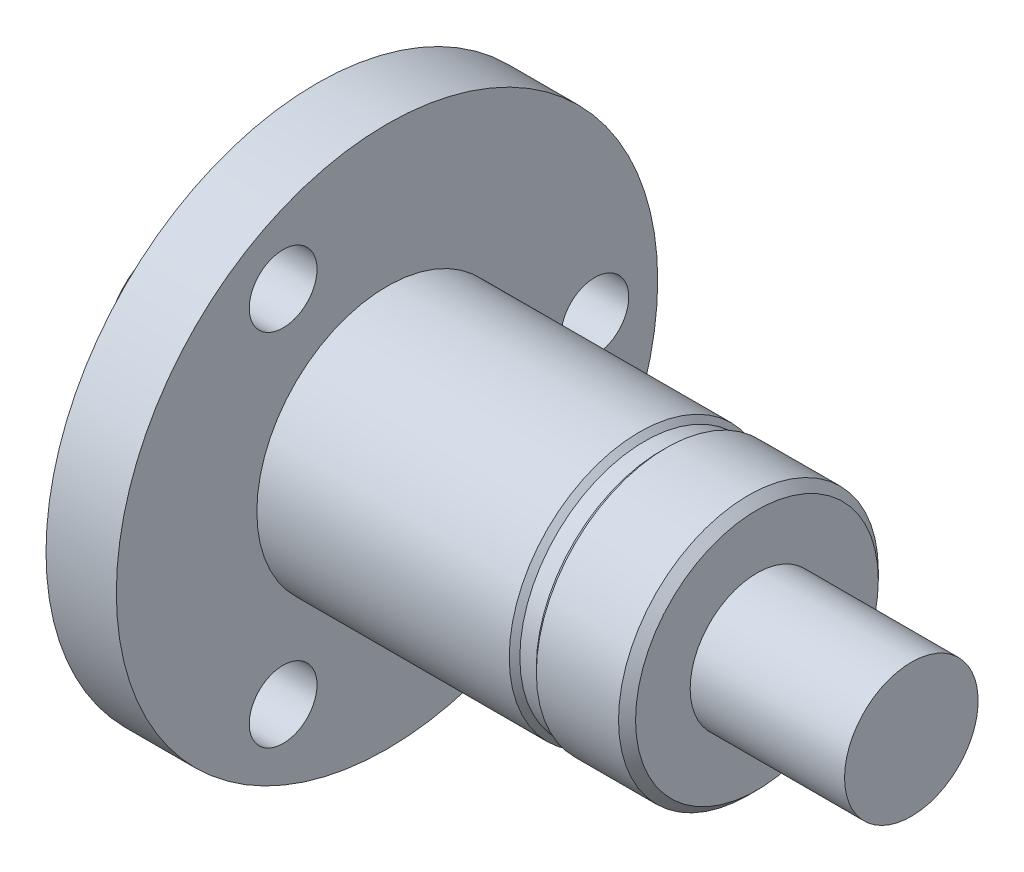
ISO-10303-21;
HEADER;
FILE_DESCRIPTION(('STEP AP214'),'2;1');
FILE_NAME('part.step','',(''),(''),'','','');
FILE_SCHEMA(('AUTOMOTIVE_DESIGN { 1 0 10303 214 1 1 1 1 }'));
ENDSEC;
DATA;
#1=APPLICATION_CONTEXT('core data for automotive mechanical design processes');
#2=APPLICATION_PROTOCOL_DEFINITION('international standard','automotive_design',2000,#1);
#3=PRODUCT_CONTEXT('',#1,'mechanical');
#4=PRODUCT('Part','Part','',(#3));
#5=PRODUCT_RELATED_PRODUCT_CATEGORY('part','',(#4));
#6=PRODUCT_DEFINITION_FORMATION('','',#4);
#7=PRODUCT_DEFINITION_CONTEXT('part definition',#1,'design');
#8=PRODUCT_DEFINITION('design','',#6,#7);
#9=PRODUCT_DEFINITION_SHAPE('','',#8);
#10=(LENGTH_UNIT() NAMED_UNIT(*) SI_UNIT(.MILLI.,.METRE.));
#11=(NAMED_UNIT(*) PLANE_ANGLE_UNIT() SI_UNIT($,.RADIAN.));
#12=(NAMED_UNIT(*) SI_UNIT($,.STERADIAN.) SOLID_ANGLE_UNIT());
#13=UNCERTAINTY_MEASURE_WITH_UNIT(LENGTH_MEASURE(1.E-05),#10,'distance_accuracy_value','');
#14=(GEOMETRIC_REPRESENTATION_CONTEXT(3) GLOBAL_UNCERTAINTY_ASSIGNED_CONTEXT((#13)) GLOBAL_UNIT_ASSIGNED_CONTEXT((#10,
#11,#12)) REPRESENTATION_CONTEXT('',''));
#15=CARTESIAN_POINT('',(0.,0.,0.));
#16=DIRECTION('',(0.,0.,1.));
#17=DIRECTION('',(1.,0.,0.));
#18=AXIS2_PLACEMENT_3D('',#15,#16,#17);
#19=CARTESIAN_POINT('',(-10.1,0.,0.));
#20=DIRECTION('',(1.,0.,0.));
#21=DIRECTION('',(0.,0.,-1.));
#22=AXIS2_PLACEMENT_3D('',#19,#20,#21);
#23=PLANE('',#22);
#24=CARTESIAN_POINT('',(-10.1,0.,0.));
#25=DIRECTION('',(-1.,0.,0.));
#26=DIRECTION('',(0.,0.,1.));
#27=AXIS2_PLACEMENT_3D('',#24,#25,#26);
#28=CIRCLE('',#27,3.13359790887331);
#29=CARTESIAN_POINT('',(-10.1,0.,3.13359790887331));
#30=VERTEX_POINT('',#29);
#31=EDGE_CURVE('E72',#30,#30,#28,.T.);
#32=ORIENTED_EDGE('',*,*,#31,.T.);
#33=EDGE_LOOP('',(#32));
#34=FACE_BOUND('',#33,.T.);
#35=ADVANCED_FACE('F34',(#34),#23,.F.);
#36=CARTESIAN_POINT('',(24.6,0.,0.));
#37=DIRECTION('',(-1.,0.,0.));
#38=DIRECTION('',(0.,0.,1.));
#39=AXIS2_PLACEMENT_3D('',#36,#37,#38);
#40=PLANE('',#39);
#41=CARTESIAN_POINT('',(24.6,0.,0.));
#42=DIRECTION('',(-1.,0.,0.));
#43=DIRECTION('',(0.,0.,1.));
#44=AXIS2_PLACEMENT_3D('',#41,#42,#43);
#45=CIRCLE('',#44,3.13359790887331);
#46=CARTESIAN_POINT('',(24.6,0.,3.13359790887331));
#47=VERTEX_POINT('',#46);
#48=EDGE_CURVE('E60',#47,#47,#45,.T.);
#49=ORIENTED_EDGE('',*,*,#48,.F.);
#50=EDGE_LOOP('',(#49));
#51=FACE_BOUND('',#50,.T.);
#52=ADVANCED_FACE('F127',(#51),#40,.F.);
#53=CARTESIAN_POINT('',(-3.3,0.,0.));
#54=DIRECTION('',(-1.,0.,0.));
#55=DIRECTION('',(0.,0.,1.));
#56=AXIS2_PLACEMENT_3D('',#53,#54,#55);
#57=CYLINDRICAL_SURFACE('',#56,3.13359790887331);
#58=ORIENTED_EDGE('',*,*,#48,.T.);
#59=EDGE_LOOP('',(#58));
#60=FACE_BOUND('',#59,.T.);
#61=CARTESIAN_POINT('',(17.3559058632868,0.,0.));
#62=DIRECTION('',(-1.,0.,0.));
#63=DIRECTION('',(0.,0.,1.));
#64=AXIS2_PLACEMENT_3D('',#61,#62,#63);
#65=CIRCLE('',#64,3.13359790887331);
#66=CARTESIAN_POINT('',(17.3559058632868,0.,3.13359790887331));
#67=VERTEX_POINT('',#66);
#68=EDGE_CURVE('E75',#67,#67,#65,.T.);
#69=ORIENTED_EDGE('',*,*,#68,.F.);
#70=EDGE_LOOP('',(#69));
#71=FACE_BOUND('',#70,.T.);
#72=ADVANCED_FACE('F133',(#60,#71),#57,.T.);
#73=CARTESIAN_POINT('',(17.3559058632868,0.,0.));
#74=DIRECTION('',(1.,0.,0.));
#75=DIRECTION('',(0.,0.,-1.));
#76=AXIS2_PLACEMENT_3D('',#73,#74,#75);
#77=PLANE('',#76);
#78=CARTESIAN_POINT('',(17.3559058632868,0.,0.));
#79=DIRECTION('',(1.,0.,0.));
#80=DIRECTION('',(0.,0.,-1.));
#81=AXIS2_PLACEMENT_3D('',#78,#79,#80);
#82=CIRCLE('',#81,5.69499999999999);
#83=CARTESIAN_POINT('',(17.3559058632868,0.,-5.69499999999999));
#84=VERTEX_POINT('',#83);
#85=EDGE_CURVE('E49',#84,#84,#82,.T.);
#86=ORIENTED_EDGE('',*,*,#85,.T.);
#87=EDGE_LOOP('',(#86));
#88=FACE_BOUND('',#87,.T.);
#89=ORIENTED_EDGE('',*,*,#68,.T.);
#90=EDGE_LOOP('',(#89));
#91=FACE_BOUND('',#90,.T.);
#92=ADVANCED_FACE('F152',(#88,#91),#77,.T.);
#93=CARTESIAN_POINT('',(-3.3,0.,0.));
#94=DIRECTION('',(-1.,0.,0.));
#95=DIRECTION('',(0.,0.,1.));
#96=AXIS2_PLACEMENT_3D('',#93,#94,#95);
#97=CYLINDRICAL_SURFACE('',#96,6.095);
#98=CARTESIAN_POINT('',(16.9559058632868,0.,0.));
#99=DIRECTION('',(1.,0.,0.));
#100=DIRECTION('',(0.,0.,-1.));
#101=AXIS2_PLACEMENT_3D('',#98,#99,#100);
#102=CIRCLE('',#101,6.095);
#103=CARTESIAN_POINT('',(16.9559058632868,0.,-6.095));
#104=VERTEX_POINT('',#103);
#105=EDGE_CURVE('E54',#104,#104,#102,.F.);
#106=ORIENTED_EDGE('',*,*,#105,.T.);
#107=EDGE_LOOP('',(#106));
#108=FACE_BOUND('',#107,.T.);
#109=CARTESIAN_POINT('',(13.1,0.,0.));
#110=DIRECTION('',(-1.,0.,0.));
#111=DIRECTION('',(0.,0.,1.));
#112=AXIS2_PLACEMENT_3D('',#109,#110,#111);
#113=CIRCLE('',#112,6.095);
#114=CARTESIAN_POINT('',(13.1,0.,6.095));
#115=VERTEX_POINT('',#114);
#116=EDGE_CURVE('E57',#115,#115,#113,.F.);
#117=ORIENTED_EDGE('',*,*,#116,.T.);
#118=EDGE_LOOP('',(#117));
#119=FACE_BOUND('',#118,.T.);
#120=ADVANCED_FACE('F124',(#108,#119),#97,.T.);
#121=CARTESIAN_POINT('',(-3.3,0.,0.));
#122=DIRECTION('',(-1.,0.,0.));
#123=DIRECTION('',(0.,0.,1.));
#124=AXIS2_PLACEMENT_3D('',#121,#122,#123);
#125=CYLINDRICAL_SURFACE('',#124,5.85946934559331);
#126=CARTESIAN_POINT('',(12.0904257445045,0.,0.));
#127=DIRECTION('',(-1.,0.,0.));
#128=DIRECTION('',(0.,0.,1.));
#129=AXIS2_PLACEMENT_3D('',#126,#127,#128);
#130=CIRCLE('',#129,5.85946934559331);
#131=CARTESIAN_POINT('',(12.0904257445045,0.,5.85946934559331));
#132=VERTEX_POINT('',#131);
#133=EDGE_CURVE('E10',#132,#132,#130,.F.);
#134=ORIENTED_EDGE('',*,*,#133,.T.);
#135=EDGE_LOOP('',(#134));
#136=FACE_BOUND('',#135,.T.);
#137=CARTESIAN_POINT('',(12.8644693455933,0.,0.));
#138=DIRECTION('',(1.,0.,0.));
#139=DIRECTION('',(0.,0.,-1.));
#140=AXIS2_PLACEMENT_3D('',#137,#138,#139);
#141=CIRCLE('',#140,5.85946934559331);
#142=CARTESIAN_POINT('',(12.8644693455933,0.,-5.85946934559331));
#143=VERTEX_POINT('',#142);
#144=EDGE_CURVE('E41',#143,#143,#141,.F.);
#145=ORIENTED_EDGE('',*,*,#144,.T.);
#146=EDGE_LOOP('',(#145));
#147=FACE_BOUND('',#146,.T.);
#148=ADVANCED_FACE('F118',(#136,#147),#125,.T.);
#149=CARTESIAN_POINT('',(-3.3,0.,0.));
#150=DIRECTION('',(-1.,0.,0.));
#151=DIRECTION('',(0.,0.,1.));
#152=AXIS2_PLACEMENT_3D('',#149,#150,#151);
#153=CYLINDRICAL_SURFACE('',#152,6.10776598530994);
#154=CARTESIAN_POINT('',(11.8421291047879,0.,0.));
#155=DIRECTION('',(1.,0.,0.));
#156=DIRECTION('',(0.,0.,-1.));
#157=AXIS2_PLACEMENT_3D('',#154,#155,#156);
#158=CIRCLE('',#157,6.10776598530994);
#159=CARTESIAN_POINT('',(11.8421291047879,0.,-6.10776598530994));
#160=VERTEX_POINT('',#159);
#161=EDGE_CURVE('E45',#160,#160,#158,.F.);
#162=ORIENTED_EDGE('',*,*,#161,.T.);
#163=EDGE_LOOP('',(#162));
#164=FACE_BOUND('',#163,.T.);
#165=CARTESIAN_POINT('',(0.,0.,0.));
#166=DIRECTION('',(-1.,0.,0.));
#167=DIRECTION('',(0.,0.,1.));
#168=AXIS2_PLACEMENT_3D('',#165,#166,#167);
#169=CIRCLE('',#168,6.10776598530994);
#170=CARTESIAN_POINT('',(0.,0.,6.10776598530994));
#171=VERTEX_POINT('',#170);
#172=EDGE_CURVE('E78',#171,#171,#169,.T.);
#173=ORIENTED_EDGE('',*,*,#172,.F.);
#174=EDGE_LOOP('',(#173));
#175=FACE_BOUND('',#174,.T.);
#176=ADVANCED_FACE('F107',(#164,#175),#153,.T.);
#177=CARTESIAN_POINT('',(0.,0.,0.));
#178=DIRECTION('',(-1.,0.,0.));
#179=DIRECTION('',(0.,0.,1.));
#180=AXIS2_PLACEMENT_3D('',#177,#178,#179);
#181=PLANE('',#180);
#182=CARTESIAN_POINT('',(0.,-8.44374768689826,4.87500000000004));
#183=DIRECTION('',(1.,0.,0.));
#184=DIRECTION('',(0.,-0.866025403784436,0.500000000000004));
#185=AXIS2_PLACEMENT_3D('',#182,#183,#184);
#186=CIRCLE('',#185,1.59);
#187=CARTESIAN_POINT('',(0.,-9.82072807891551,5.67000000000005));
#188=VERTEX_POINT('',#187);
#189=EDGE_CURVE('E68',#188,#188,#186,.T.);
#190=ORIENTED_EDGE('',*,*,#189,.F.);
#191=EDGE_LOOP('',(#190));
#192=FACE_BOUND('',#191,.T.);
#193=CARTESIAN_POINT('',(0.,8.44374768689832,4.87499999999992));
#194=DIRECTION('',(1.,0.,0.));
#195=DIRECTION('',(0.,0.866025403784443,0.499999999999992));
#196=AXIS2_PLACEMENT_3D('',#193,#194,#195);
#197=CIRCLE('',#196,1.59);
#198=CARTESIAN_POINT('',(0.,9.82072807891558,5.66999999999991));
#199=VERTEX_POINT('',#198);
#200=EDGE_CURVE('E94',#199,#199,#197,.T.);
#201=ORIENTED_EDGE('',*,*,#200,.F.);
#202=EDGE_LOOP('',(#201));
#203=FACE_BOUND('',#202,.T.);
#204=CARTESIAN_POINT('',(0.,0.,-9.75));
#205=DIRECTION('',(1.,0.,0.));
#206=DIRECTION('',(0.,0.,-1.));
#207=AXIS2_PLACEMENT_3D('',#204,#205,#206);
#208=CIRCLE('',#207,1.59);
#209=CARTESIAN_POINT('',(0.,0.,-11.34));
#210=VERTEX_POINT('',#209);
#211=EDGE_CURVE('E64',#210,#210,#208,.T.);
#212=ORIENTED_EDGE('',*,*,#211,.F.);
#213=EDGE_LOOP('',(#212));
#214=FACE_BOUND('',#213,.T.);
#215=CARTESIAN_POINT('',(0.,0.,0.));
#216=DIRECTION('',(-1.,0.,0.));
#217=DIRECTION('',(0.,0.,1.));
#218=AXIS2_PLACEMENT_3D('',#215,#216,#217);
#219=CIRCLE('',#218,12.7);
#220=CARTESIAN_POINT('',(0.,0.,12.7));
#221=VERTEX_POINT('',#220);
#222=EDGE_CURVE('E81',#221,#221,#219,.T.);
#223=ORIENTED_EDGE('',*,*,#222,.F.);
#224=EDGE_LOOP('',(#223));
#225=FACE_BOUND('',#224,.T.);
#226=ORIENTED_EDGE('',*,*,#172,.T.);
#227=EDGE_LOOP('',(#226));
#228=FACE_BOUND('',#227,.T.);
#229=ADVANCED_FACE('F103',(#192,#203,#214,#225,#228),#181,.F.);
#230=CARTESIAN_POINT('',(-3.3,0.,0.));
#231=DIRECTION('',(-1.,0.,0.));
#232=DIRECTION('',(0.,0.,1.));
#233=AXIS2_PLACEMENT_3D('',#230,#231,#232);
#234=CYLINDRICAL_SURFACE('',#233,12.7);
#235=CARTESIAN_POINT('',(-3.3,0.,0.));
#236=DIRECTION('',(-1.,0.,0.));
#237=DIRECTION('',(0.,0.,1.));
#238=AXIS2_PLACEMENT_3D('',#235,#236,#237);
#239=CIRCLE('',#238,12.7);
#240=CARTESIAN_POINT('',(-3.3,0.,12.7));
#241=VERTEX_POINT('',#240);
#242=EDGE_CURVE('E84',#241,#241,#239,.T.);
#243=ORIENTED_EDGE('',*,*,#242,.F.);
#244=EDGE_LOOP('',(#243));
#245=FACE_BOUND('',#244,.T.);
#246=ORIENTED_EDGE('',*,*,#222,.T.);
#247=EDGE_LOOP('',(#246));
#248=FACE_BOUND('',#247,.T.);
#249=ADVANCED_FACE('F106',(#245,#248),#234,.T.);
#250=CARTESIAN_POINT('',(-3.3,0.,0.));
#251=DIRECTION('',(1.,0.,0.));
#252=DIRECTION('',(0.,0.,-1.));
#253=AXIS2_PLACEMENT_3D('',#250,#251,#252);
#254=PLANE('',#253);
#255=CARTESIAN_POINT('',(-3.3,-8.44374768689826,4.87500000000004));
#256=DIRECTION('',(1.,0.,0.));
#257=DIRECTION('',(0.,0.,-1.));
#258=AXIS2_PLACEMENT_3D('',#255,#256,#257);
#259=CIRCLE('',#258,1.59);
#260=CARTESIAN_POINT('',(-3.3,-8.44374768689826,3.28500000000004));
#261=VERTEX_POINT('',#260);
#262=EDGE_CURVE('E61',#261,#261,#259,.T.);
#263=ORIENTED_EDGE('',*,*,#262,.T.);
#264=EDGE_LOOP('',(#263));
#265=FACE_BOUND('',#264,.T.);
#266=CARTESIAN_POINT('',(-3.3,8.44374768689832,4.87499999999992));
#267=DIRECTION('',(1.,0.,0.));
#268=DIRECTION('',(0.,0.,-1.));
#269=AXIS2_PLACEMENT_3D('',#266,#267,#268);
#270=CIRCLE('',#269,1.59);
#271=CARTESIAN_POINT('',(-3.3,8.44374768689832,3.28499999999992));
#272=VERTEX_POINT('',#271);
#273=EDGE_CURVE('E65',#272,#272,#270,.T.);
#274=ORIENTED_EDGE('',*,*,#273,.T.);
#275=EDGE_LOOP('',(#274));
#276=FACE_BOUND('',#275,.T.);
#277=CARTESIAN_POINT('',(-3.3,0.,-9.75));
#278=DIRECTION('',(1.,0.,0.));
#279=DIRECTION('',(0.,0.,-1.));
#280=AXIS2_PLACEMENT_3D('',#277,#278,#279);
#281=CIRCLE('',#280,1.59);
#282=CARTESIAN_POINT('',(-3.3,0.,-11.34));
#283=VERTEX_POINT('',#282);
#284=EDGE_CURVE('E69',#283,#283,#281,.T.);
#285=ORIENTED_EDGE('',*,*,#284,.T.);
#286=EDGE_LOOP('',(#285));
#287=FACE_BOUND('',#286,.T.);
#288=CARTESIAN_POINT('',(-3.3,0.,0.));
#289=DIRECTION('',(-1.,0.,0.));
#290=DIRECTION('',(0.,0.,1.));
#291=AXIS2_PLACEMENT_3D('',#288,#289,#290);
#292=CIRCLE('',#291,3.13359790887331);
#293=CARTESIAN_POINT('',(-3.3,0.,3.13359790887331));
#294=VERTEX_POINT('',#293);
#295=EDGE_CURVE('E87',#294,#294,#292,.T.);
#296=ORIENTED_EDGE('',*,*,#295,.F.);
#297=EDGE_LOOP('',(#296));
#298=FACE_BOUND('',#297,.T.);
#299=ORIENTED_EDGE('',*,*,#242,.T.);
#300=EDGE_LOOP('',(#299));
#301=FACE_BOUND('',#300,.T.);
#302=ADVANCED_FACE('F239',(#265,#276,#287,#298,#301),#254,.F.);
#303=CARTESIAN_POINT('',(-3.3,0.,0.));
#304=DIRECTION('',(-1.,0.,0.));
#305=DIRECTION('',(0.,0.,1.));
#306=AXIS2_PLACEMENT_3D('',#303,#304,#305);
#307=CYLINDRICAL_SURFACE('',#306,3.13359790887331);
#308=ORIENTED_EDGE('',*,*,#295,.T.);
#309=EDGE_LOOP('',(#308));
#310=FACE_BOUND('',#309,.T.);
#311=ORIENTED_EDGE('',*,*,#31,.F.);
#312=EDGE_LOOP('',(#311));
#313=FACE_BOUND('',#312,.T.);
#314=ADVANCED_FACE('F230',(#310,#313),#307,.T.);
#315=CARTESIAN_POINT('',(-10.,0.,-9.75));
#316=DIRECTION('',(1.,0.,0.));
#317=DIRECTION('',(0.,0.,-1.));
#318=AXIS2_PLACEMENT_3D('',#315,#316,#317);
#319=CYLINDRICAL_SURFACE('',#318,1.59);
#320=ORIENTED_EDGE('',*,*,#211,.T.);
#321=EDGE_LOOP('',(#320));
#322=FACE_BOUND('',#321,.T.);
#323=ORIENTED_EDGE('',*,*,#284,.F.);
#324=EDGE_LOOP('',(#323));
#325=FACE_BOUND('',#324,.T.);
#326=ADVANCED_FACE('F221',(#322,#325),#319,.F.);
#327=CARTESIAN_POINT('',(-10.,8.44374768689832,4.87499999999992));
#328=DIRECTION('',(1.,0.,0.));
#329=DIRECTION('',(0.,0.,-1.));
#330=AXIS2_PLACEMENT_3D('',#327,#328,#329);
#331=CYLINDRICAL_SURFACE('',#330,1.59);
#332=ORIENTED_EDGE('',*,*,#200,.T.);
#333=EDGE_LOOP('',(#332));
#334=FACE_BOUND('',#333,.T.);
#335=ORIENTED_EDGE('',*,*,#273,.F.);
#336=EDGE_LOOP('',(#335));
#337=FACE_BOUND('',#336,.T.);
#338=ADVANCED_FACE('F217',(#334,#337),#331,.F.);
#339=CARTESIAN_POINT('',(-10.,-8.44374768689826,4.87500000000004));
#340=DIRECTION('',(1.,0.,0.));
#341=DIRECTION('',(0.,0.,-1.));
#342=AXIS2_PLACEMENT_3D('',#339,#340,#341);
#343=CYLINDRICAL_SURFACE('',#342,1.59);
#344=ORIENTED_EDGE('',*,*,#189,.T.);
#345=EDGE_LOOP('',(#344));
#346=FACE_BOUND('',#345,.T.);
#347=ORIENTED_EDGE('',*,*,#262,.F.);
#348=EDGE_LOOP('',(#347));
#349=FACE_BOUND('',#348,.T.);
#350=ADVANCED_FACE('F100',(#346,#349),#343,.F.);
#351=CARTESIAN_POINT('',(16.9559058632868,0.,0.));
#352=DIRECTION('',(-1.,0.,0.));
#353=DIRECTION('',(0.,0.,1.));
#354=AXIS2_PLACEMENT_3D('',#351,#352,#353);
#355=CONICAL_SURFACE('',#354,6.095,0.785398163397448);
#356=ORIENTED_EDGE('',*,*,#85,.F.);
#357=EDGE_LOOP('',(#356));
#358=FACE_BOUND('',#357,.T.);
#359=ORIENTED_EDGE('',*,*,#105,.F.);
#360=EDGE_LOOP('',(#359));
#361=FACE_BOUND('',#360,.T.);
#362=ADVANCED_FACE('F138',(#358,#361),#355,.T.);
#363=CARTESIAN_POINT('',(12.7,0.,0.));
#364=DIRECTION('',(1.,0.,0.));
#365=DIRECTION('',(0.,0.,-1.));
#366=AXIS2_PLACEMENT_3D('',#363,#364,#365);
#367=CONICAL_SURFACE('',#366,5.69499999999999,0.785398163397451);
#368=ORIENTED_EDGE('',*,*,#116,.F.);
#369=EDGE_LOOP('',(#368));
#370=FACE_BOUND('',#369,.T.);
#371=ORIENTED_EDGE('',*,*,#144,.F.);
#372=EDGE_LOOP('',(#371));
#373=FACE_BOUND('',#372,.T.);
#374=ADVANCED_FACE('F140',(#370,#373),#367,.T.);
#375=CARTESIAN_POINT('',(11.8421291047879,0.,0.));
#376=DIRECTION('',(-1.,0.,0.));
#377=DIRECTION('',(0.,0.,1.));
#378=AXIS2_PLACEMENT_3D('',#375,#376,#377);
#379=CONICAL_SURFACE('',#378,6.10776598530994,0.785398163397446);
#380=ORIENTED_EDGE('',*,*,#133,.F.);
#381=EDGE_LOOP('',(#380));
#382=FACE_BOUND('',#381,.T.);
#383=ORIENTED_EDGE('',*,*,#161,.F.);
#384=EDGE_LOOP('',(#383));
#385=FACE_BOUND('',#384,.T.);
#386=ADVANCED_FACE('F36',(#382,#385),#379,.T.);
#387=CLOSED_SHELL('',(#35,#52,#72,#92,#120,#148,#176,#229,#249,#302,#314,#326,#338,#350,#362,
#374,#386));
#388=MANIFOLD_SOLID_BREP('B2',#387);
#389=ADVANCED_BREP_SHAPE_REPRESENTATION('',(#18,#388),#14);
#390=SHAPE_DEFINITION_REPRESENTATION(#9,#389);
ENDSEC;
END-ISO-10303-21;
